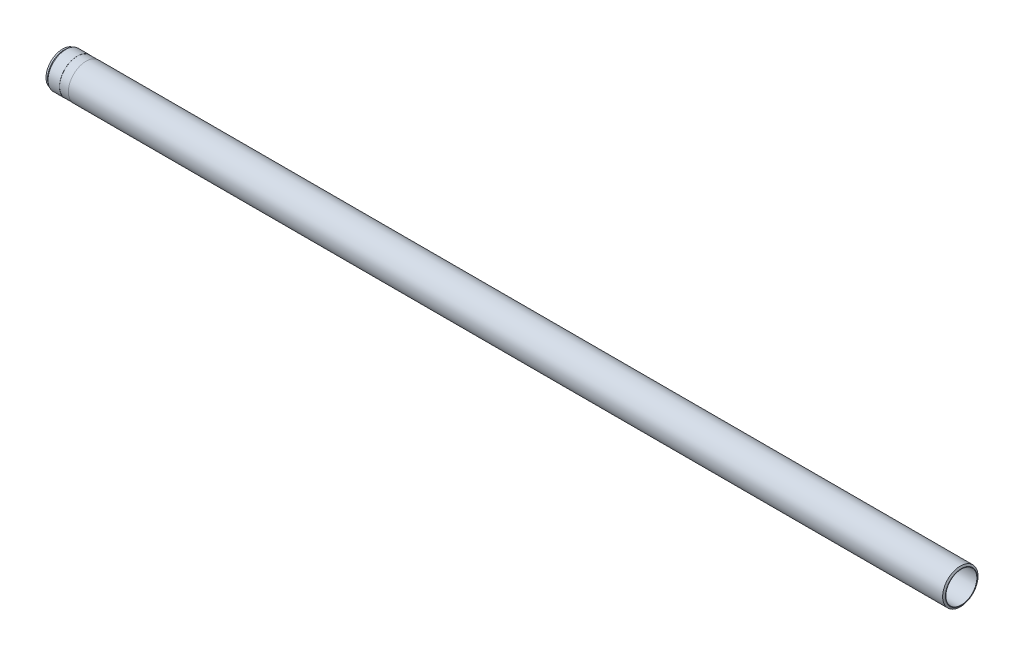
ISO-10303-21;
HEADER;
FILE_DESCRIPTION(('STEP AP214'),'2;1');
FILE_NAME('part.step','',(''),(''),'','','');
FILE_SCHEMA(('AUTOMOTIVE_DESIGN { 1 0 10303 214 1 1 1 1 }'));
ENDSEC;
DATA;
#1=APPLICATION_CONTEXT('core data for automotive mechanical design processes');
#2=APPLICATION_PROTOCOL_DEFINITION('international standard','automotive_design',2000,#1);
#3=PRODUCT_CONTEXT('',#1,'mechanical');
#4=PRODUCT('Part','Part','',(#3));
#5=PRODUCT_RELATED_PRODUCT_CATEGORY('part','',(#4));
#6=PRODUCT_DEFINITION_FORMATION('','',#4);
#7=PRODUCT_DEFINITION_CONTEXT('part definition',#1,'design');
#8=PRODUCT_DEFINITION('design','',#6,#7);
#9=PRODUCT_DEFINITION_SHAPE('','',#8);
#10=(LENGTH_UNIT() NAMED_UNIT(*) SI_UNIT(.MILLI.,.METRE.));
#11=(NAMED_UNIT(*) PLANE_ANGLE_UNIT() SI_UNIT($,.RADIAN.));
#12=(NAMED_UNIT(*) SI_UNIT($,.STERADIAN.) SOLID_ANGLE_UNIT());
#13=UNCERTAINTY_MEASURE_WITH_UNIT(LENGTH_MEASURE(1.E-05),#10,'distance_accuracy_value','');
#14=(GEOMETRIC_REPRESENTATION_CONTEXT(3) GLOBAL_UNCERTAINTY_ASSIGNED_CONTEXT((#13)) GLOBAL_UNIT_ASSIGNED_CONTEXT((#10,
#11,#12)) REPRESENTATION_CONTEXT('',''));
#15=CARTESIAN_POINT('',(0.,0.,0.));
#16=DIRECTION('',(0.,0.,1.));
#17=DIRECTION('',(1.,0.,0.));
#18=AXIS2_PLACEMENT_3D('',#15,#16,#17);
#19=CARTESIAN_POINT('',(0.,0.,0.));
#20=DIRECTION('',(-1.,0.,0.));
#21=DIRECTION('',(0.,0.,1.));
#22=AXIS2_PLACEMENT_3D('',#19,#20,#21);
#23=CONICAL_SURFACE('',#22,36.,1.0471975511966);
#24=CARTESIAN_POINT('',(-2.30940107675859,0.,0.));
#25=DIRECTION('',(-1.,0.,0.));
#26=DIRECTION('',(0.,0.,1.));
#27=AXIS2_PLACEMENT_3D('',#24,#25,#26);
#28=CIRCLE('',#27,40.);
#29=CARTESIAN_POINT('',(-2.30940107675859,0.,40.));
#30=VERTEX_POINT('',#29);
#31=EDGE_CURVE('E10',#30,#30,#28,.T.);
#32=ORIENTED_EDGE('',*,*,#31,.F.);
#33=EDGE_LOOP('',(#32));
#34=FACE_BOUND('',#33,.T.);
#35=CARTESIAN_POINT('',(0.,0.,0.));
#36=DIRECTION('',(-1.,0.,0.));
#37=DIRECTION('',(0.,0.,1.));
#38=AXIS2_PLACEMENT_3D('',#35,#36,#37);
#39=CIRCLE('',#38,36.);
#40=CARTESIAN_POINT('',(0.,0.,36.));
#41=VERTEX_POINT('',#40);
#42=EDGE_CURVE('E87',#41,#41,#39,.T.);
#43=ORIENTED_EDGE('',*,*,#42,.T.);
#44=EDGE_LOOP('',(#43));
#45=FACE_BOUND('',#44,.T.);
#46=ADVANCED_FACE('F41',(#34,#45),#23,.T.);
#47=CARTESIAN_POINT('',(-122.784188741722,0.,0.));
#48=DIRECTION('',(-1.,0.,0.));
#49=DIRECTION('',(0.,0.,1.));
#50=AXIS2_PLACEMENT_3D('',#47,#48,#49);
#51=CYLINDRICAL_SURFACE('',#50,39.9999999999999);
#52=CARTESIAN_POINT('',(-1978.,0.,2.73238558940802E-13));
#53=DIRECTION('',(-1.,0.,0.));
#54=DIRECTION('',(0.,0.,1.));
#55=AXIS2_PLACEMENT_3D('',#52,#53,#54);
#56=CIRCLE('',#55,39.9999999999998);
#57=CARTESIAN_POINT('',(-1978.,0.,40.));
#58=VERTEX_POINT('',#57);
#59=EDGE_CURVE('E47',#58,#58,#56,.T.);
#60=ORIENTED_EDGE('',*,*,#59,.F.);
#61=EDGE_LOOP('',(#60));
#62=FACE_BOUND('',#61,.T.);
#63=ORIENTED_EDGE('',*,*,#31,.T.);
#64=EDGE_LOOP('',(#63));
#65=FACE_BOUND('',#64,.T.);
#66=ADVANCED_FACE('F160',(#62,#65),#51,.T.);
#67=CARTESIAN_POINT('',(-1978.,39.9999999999998,2.55474990546799E-13));
#68=DIRECTION('',(1.,0.,0.));
#69=DIRECTION('',(0.,0.,-1.));
#70=AXIS2_PLACEMENT_3D('',#67,#68,#69);
#71=PLANE('',#70);
#72=CARTESIAN_POINT('',(-1978.,0.,2.73238558940802E-13));
#73=DIRECTION('',(-1.,0.,0.));
#74=DIRECTION('',(0.,0.,1.));
#75=AXIS2_PLACEMENT_3D('',#72,#73,#74);
#76=CIRCLE('',#75,39.75);
#77=CARTESIAN_POINT('',(-1978.,0.,39.7500000000003));
#78=VERTEX_POINT('',#77);
#79=EDGE_CURVE('E51',#78,#78,#76,.T.);
#80=ORIENTED_EDGE('',*,*,#79,.F.);
#81=EDGE_LOOP('',(#80));
#82=FACE_BOUND('',#81,.T.);
#83=ORIENTED_EDGE('',*,*,#59,.T.);
#84=EDGE_LOOP('',(#83));
#85=FACE_BOUND('',#84,.T.);
#86=ADVANCED_FACE('F155',(#82,#85),#71,.F.);
#87=CARTESIAN_POINT('',(-122.784188741722,0.,0.));
#88=DIRECTION('',(-1.,0.,0.));
#89=DIRECTION('',(0.,0.,1.));
#90=AXIS2_PLACEMENT_3D('',#87,#88,#89);
#91=CYLINDRICAL_SURFACE('',#90,39.75);
#92=CARTESIAN_POINT('',(-1998.,0.,2.76001335067605E-13));
#93=DIRECTION('',(-1.,0.,0.));
#94=DIRECTION('',(0.,0.,1.));
#95=AXIS2_PLACEMENT_3D('',#92,#93,#94);
#96=CIRCLE('',#95,39.75);
#97=CARTESIAN_POINT('',(-1998.,0.,39.7500000000003));
#98=VERTEX_POINT('',#97);
#99=EDGE_CURVE('E55',#98,#98,#96,.T.);
#100=ORIENTED_EDGE('',*,*,#99,.F.);
#101=EDGE_LOOP('',(#100));
#102=FACE_BOUND('',#101,.T.);
#103=ORIENTED_EDGE('',*,*,#79,.T.);
#104=EDGE_LOOP('',(#103));
#105=FACE_BOUND('',#104,.T.);
#106=ADVANCED_FACE('F149',(#102,#105),#91,.T.);
#107=CARTESIAN_POINT('',(-1998.,39.75,2.58348788976065E-13));
#108=DIRECTION('',(-1.,0.,0.));
#109=DIRECTION('',(0.,0.,1.));
#110=AXIS2_PLACEMENT_3D('',#107,#108,#109);
#111=PLANE('',#110);
#112=CARTESIAN_POINT('',(-1998.,0.,2.76001335067605E-13));
#113=DIRECTION('',(-1.,0.,0.));
#114=DIRECTION('',(0.,0.,1.));
#115=AXIS2_PLACEMENT_3D('',#112,#113,#114);
#116=CIRCLE('',#115,39.9999999999998);
#117=CARTESIAN_POINT('',(-1998.,0.,40.));
#118=VERTEX_POINT('',#117);
#119=EDGE_CURVE('E60',#118,#118,#116,.T.);
#120=ORIENTED_EDGE('',*,*,#119,.F.);
#121=EDGE_LOOP('',(#120));
#122=FACE_BOUND('',#121,.T.);
#123=ORIENTED_EDGE('',*,*,#99,.T.);
#124=EDGE_LOOP('',(#123));
#125=FACE_BOUND('',#124,.T.);
#126=ADVANCED_FACE('F143',(#122,#125),#111,.F.);
#127=CARTESIAN_POINT('',(-122.784188741722,0.,0.));
#128=DIRECTION('',(-1.,0.,0.));
#129=DIRECTION('',(0.,0.,1.));
#130=AXIS2_PLACEMENT_3D('',#127,#128,#129);
#131=CYLINDRICAL_SURFACE('',#130,39.9999999999998);
#132=CARTESIAN_POINT('',(-2023.92962998315,0.,2.79583223202318E-13));
#133=DIRECTION('',(-1.,0.,0.));
#134=DIRECTION('',(0.,0.,1.));
#135=AXIS2_PLACEMENT_3D('',#132,#133,#134);
#136=CIRCLE('',#135,39.9999999999998);
#137=CARTESIAN_POINT('',(-2023.92962998315,0.,40.));
#138=VERTEX_POINT('',#137);
#139=EDGE_CURVE('E63',#138,#138,#136,.T.);
#140=ORIENTED_EDGE('',*,*,#139,.F.);
#141=EDGE_LOOP('',(#140));
#142=FACE_BOUND('',#141,.T.);
#143=ORIENTED_EDGE('',*,*,#119,.T.);
#144=EDGE_LOOP('',(#143));
#145=FACE_BOUND('',#144,.T.);
#146=ADVANCED_FACE('F137',(#142,#145),#131,.T.);
#147=CARTESIAN_POINT('',(-2023.92962998315,0.,2.79583223202318E-13));
#148=DIRECTION('',(1.,0.,0.));
#149=DIRECTION('',(0.,0.,-1.));
#150=AXIS2_PLACEMENT_3D('',#147,#148,#149);
#151=CONICAL_SURFACE('',#150,39.9999999999998,0.610865238197979);
#152=CARTESIAN_POINT('',(-2027.5,0.,2.80076429854639E-13));
#153=DIRECTION('',(-1.,0.,0.));
#154=DIRECTION('',(0.,0.,1.));
#155=AXIS2_PLACEMENT_3D('',#152,#153,#154);
#156=CIRCLE('',#155,37.5);
#157=CARTESIAN_POINT('',(-2027.5,0.,37.5000000000003));
#158=VERTEX_POINT('',#157);
#159=EDGE_CURVE('E66',#158,#158,#156,.T.);
#160=ORIENTED_EDGE('',*,*,#159,.F.);
#161=EDGE_LOOP('',(#160));
#162=FACE_BOUND('',#161,.T.);
#163=ORIENTED_EDGE('',*,*,#139,.T.);
#164=EDGE_LOOP('',(#163));
#165=FACE_BOUND('',#164,.T.);
#166=ADVANCED_FACE('F131',(#162,#165),#151,.T.);
#167=CARTESIAN_POINT('',(-122.784188741722,0.,0.));
#168=DIRECTION('',(-1.,0.,0.));
#169=DIRECTION('',(0.,0.,1.));
#170=AXIS2_PLACEMENT_3D('',#167,#168,#169);
#171=CYLINDRICAL_SURFACE('',#170,37.5);
#172=CARTESIAN_POINT('',(-2031.,0.,2.80559915676829E-13));
#173=DIRECTION('',(-1.,0.,0.));
#174=DIRECTION('',(0.,0.,1.));
#175=AXIS2_PLACEMENT_3D('',#172,#173,#174);
#176=CIRCLE('',#175,37.5);
#177=CARTESIAN_POINT('',(-2031.,0.,37.5000000000003));
#178=VERTEX_POINT('',#177);
#179=EDGE_CURVE('E69',#178,#178,#176,.T.);
#180=ORIENTED_EDGE('',*,*,#179,.F.);
#181=EDGE_LOOP('',(#180));
#182=FACE_BOUND('',#181,.T.);
#183=ORIENTED_EDGE('',*,*,#159,.T.);
#184=EDGE_LOOP('',(#183));
#185=FACE_BOUND('',#184,.T.);
#186=ADVANCED_FACE('F125',(#182,#185),#171,.T.);
#187=CARTESIAN_POINT('',(-2031.,37.5,2.63906570307452E-13));
#188=DIRECTION('',(1.,0.,0.));
#189=DIRECTION('',(0.,0.,-1.));
#190=AXIS2_PLACEMENT_3D('',#187,#188,#189);
#191=PLANE('',#190);
#192=CARTESIAN_POINT('',(-2031.,0.,2.80559915676829E-13));
#193=DIRECTION('',(-1.,0.,0.));
#194=DIRECTION('',(0.,0.,1.));
#195=AXIS2_PLACEMENT_3D('',#192,#193,#194);
#196=CIRCLE('',#195,35.7273502691896);
#197=CARTESIAN_POINT('',(-2031.,0.,35.7273502691898));
#198=VERTEX_POINT('',#197);
#199=EDGE_CURVE('E72',#198,#198,#196,.T.);
#200=ORIENTED_EDGE('',*,*,#199,.F.);
#201=EDGE_LOOP('',(#200));
#202=FACE_BOUND('',#201,.T.);
#203=ORIENTED_EDGE('',*,*,#179,.T.);
#204=EDGE_LOOP('',(#203));
#205=FACE_BOUND('',#204,.T.);
#206=ADVANCED_FACE('F119',(#202,#205),#191,.F.);
#207=CARTESIAN_POINT('',(-2031.,0.,2.80559915676829E-13));
#208=DIRECTION('',(-1.,0.,0.));
#209=DIRECTION('',(0.,0.,1.));
#210=AXIS2_PLACEMENT_3D('',#207,#208,#209);
#211=CONICAL_SURFACE('',#210,35.7273502691896,0.5235987755983);
#212=CARTESIAN_POINT('',(-2030.,0.,2.80421776870489E-13));
#213=DIRECTION('',(-1.,0.,0.));
#214=DIRECTION('',(0.,0.,1.));
#215=AXIS2_PLACEMENT_3D('',#212,#213,#214);
#216=CIRCLE('',#215,35.15);
#217=CARTESIAN_POINT('',(-2030.,0.,35.1500000000003));
#218=VERTEX_POINT('',#217);
#219=EDGE_CURVE('E75',#218,#218,#216,.T.);
#220=ORIENTED_EDGE('',*,*,#219,.F.);
#221=EDGE_LOOP('',(#220));
#222=FACE_BOUND('',#221,.T.);
#223=ORIENTED_EDGE('',*,*,#199,.T.);
#224=EDGE_LOOP('',(#223));
#225=FACE_BOUND('',#224,.T.);
#226=ADVANCED_FACE('F113',(#222,#225),#211,.F.);
#227=CARTESIAN_POINT('',(-122.784188741722,0.,0.));
#228=DIRECTION('',(-1.,0.,0.));
#229=DIRECTION('',(0.,0.,1.));
#230=AXIS2_PLACEMENT_3D('',#227,#228,#229);
#231=CYLINDRICAL_SURFACE('',#230,35.15);
#232=CARTESIAN_POINT('',(-2016.,0.,2.78487833581727E-13));
#233=DIRECTION('',(-1.,0.,0.));
#234=DIRECTION('',(0.,0.,1.));
#235=AXIS2_PLACEMENT_3D('',#232,#233,#234);
#236=CIRCLE('',#235,35.15);
#237=CARTESIAN_POINT('',(-2016.,0.,35.1500000000003));
#238=VERTEX_POINT('',#237);
#239=EDGE_CURVE('E78',#238,#238,#236,.T.);
#240=ORIENTED_EDGE('',*,*,#239,.F.);
#241=EDGE_LOOP('',(#240));
#242=FACE_BOUND('',#241,.T.);
#243=ORIENTED_EDGE('',*,*,#219,.T.);
#244=EDGE_LOOP('',(#243));
#245=FACE_BOUND('',#244,.T.);
#246=ADVANCED_FACE('F107',(#242,#245),#231,.F.);
#247=CARTESIAN_POINT('',(-2016.,0.,2.78487833581727E-13));
#248=DIRECTION('',(-1.,0.,0.));
#249=DIRECTION('',(0.,0.,1.));
#250=AXIS2_PLACEMENT_3D('',#247,#248,#249);
#251=CONICAL_SURFACE('',#250,35.15,0.523598775598696);
#252=CARTESIAN_POINT('',(-2015.74019237887,0.,2.78451944067065E-13));
#253=DIRECTION('',(-1.,0.,0.));
#254=DIRECTION('',(0.,0.,1.));
#255=AXIS2_PLACEMENT_3D('',#252,#253,#254);
#256=CIRCLE('',#255,35.);
#257=CARTESIAN_POINT('',(-2015.74019237887,0.,35.0000000000003));
#258=VERTEX_POINT('',#257);
#259=EDGE_CURVE('E81',#258,#258,#256,.T.);
#260=ORIENTED_EDGE('',*,*,#259,.F.);
#261=EDGE_LOOP('',(#260));
#262=FACE_BOUND('',#261,.T.);
#263=ORIENTED_EDGE('',*,*,#239,.T.);
#264=EDGE_LOOP('',(#263));
#265=FACE_BOUND('',#264,.T.);
#266=ADVANCED_FACE('F101',(#262,#265),#251,.F.);
#267=CARTESIAN_POINT('',(-122.784188741722,0.,0.));
#268=DIRECTION('',(-1.,0.,0.));
#269=DIRECTION('',(0.,0.,1.));
#270=AXIS2_PLACEMENT_3D('',#267,#268,#269);
#271=CYLINDRICAL_SURFACE('',#270,35.);
#272=CARTESIAN_POINT('',(0.,0.,0.));
#273=DIRECTION('',(-1.,0.,0.));
#274=DIRECTION('',(0.,0.,1.));
#275=AXIS2_PLACEMENT_3D('',#272,#273,#274);
#276=CIRCLE('',#275,35.);
#277=CARTESIAN_POINT('',(0.,0.,35.));
#278=VERTEX_POINT('',#277);
#279=EDGE_CURVE('E84',#278,#278,#276,.T.);
#280=ORIENTED_EDGE('',*,*,#279,.F.);
#281=EDGE_LOOP('',(#280));
#282=FACE_BOUND('',#281,.T.);
#283=ORIENTED_EDGE('',*,*,#259,.T.);
#284=EDGE_LOOP('',(#283));
#285=FACE_BOUND('',#284,.T.);
#286=ADVANCED_FACE('F95',(#282,#285),#271,.F.);
#287=CARTESIAN_POINT('',(0.,35.,0.));
#288=DIRECTION('',(-1.,0.,0.));
#289=DIRECTION('',(0.,0.,1.));
#290=AXIS2_PLACEMENT_3D('',#287,#288,#289);
#291=PLANE('',#290);
#292=ORIENTED_EDGE('',*,*,#42,.F.);
#293=EDGE_LOOP('',(#292));
#294=FACE_BOUND('',#293,.T.);
#295=ORIENTED_EDGE('',*,*,#279,.T.);
#296=EDGE_LOOP('',(#295));
#297=FACE_BOUND('',#296,.T.);
#298=ADVANCED_FACE('F92',(#294,#297),#291,.F.);
#299=CLOSED_SHELL('',(#46,#66,#86,#106,#126,#146,#166,#186,#206,#226,#246,#266,#286,#298));
#300=MANIFOLD_SOLID_BREP('B2',#299);
#301=ADVANCED_BREP_SHAPE_REPRESENTATION('',(#18,#300),#14);
#302=SHAPE_DEFINITION_REPRESENTATION(#9,#301);
ENDSEC;
END-ISO-10303-21;
